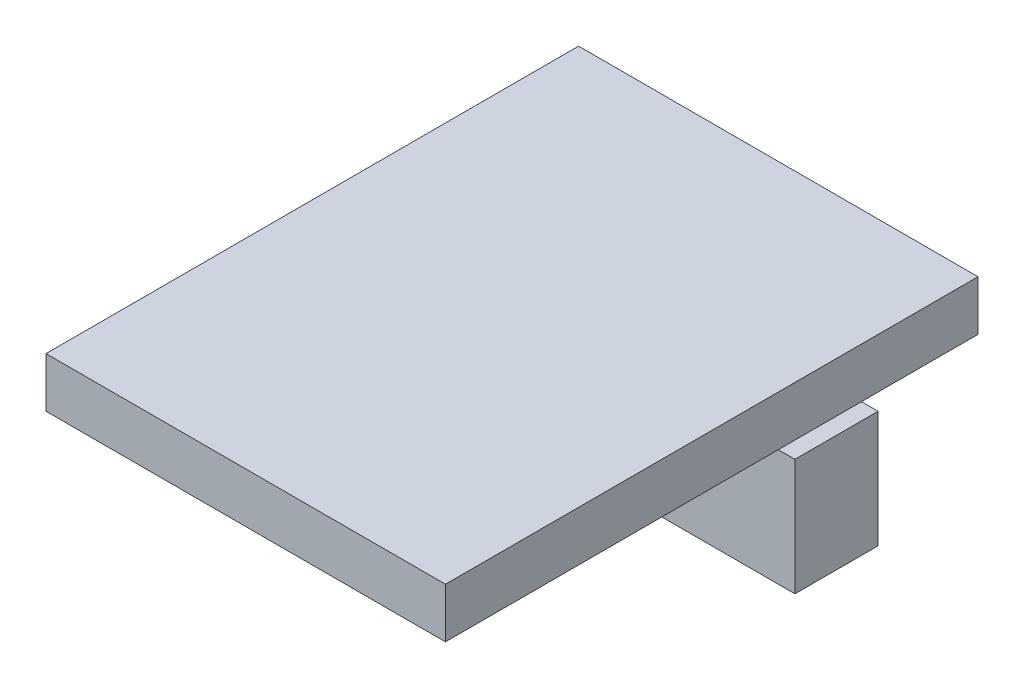
ISO-10303-21;
HEADER;
FILE_DESCRIPTION(('STEP AP214'),'2;1');
FILE_NAME('part.step','',(''),(''),'','','');
FILE_SCHEMA(('AUTOMOTIVE_DESIGN { 1 0 10303 214 1 1 1 1 }'));
ENDSEC;
DATA;
#1=APPLICATION_CONTEXT('core data for automotive mechanical design processes');
#2=APPLICATION_PROTOCOL_DEFINITION('international standard','automotive_design',2000,#1);
#3=PRODUCT_CONTEXT('',#1,'mechanical');
#4=PRODUCT('Part','Part','',(#3));
#5=PRODUCT_RELATED_PRODUCT_CATEGORY('part','',(#4));
#6=PRODUCT_DEFINITION_FORMATION('','',#4);
#7=PRODUCT_DEFINITION_CONTEXT('part definition',#1,'design');
#8=PRODUCT_DEFINITION('design','',#6,#7);
#9=PRODUCT_DEFINITION_SHAPE('','',#8);
#10=(LENGTH_UNIT() NAMED_UNIT(*) SI_UNIT(.MILLI.,.METRE.));
#11=(NAMED_UNIT(*) PLANE_ANGLE_UNIT() SI_UNIT($,.RADIAN.));
#12=(NAMED_UNIT(*) SI_UNIT($,.STERADIAN.) SOLID_ANGLE_UNIT());
#13=UNCERTAINTY_MEASURE_WITH_UNIT(LENGTH_MEASURE(1.E-05),#10,'distance_accuracy_value','');
#14=(GEOMETRIC_REPRESENTATION_CONTEXT(3) GLOBAL_UNCERTAINTY_ASSIGNED_CONTEXT((#13)) GLOBAL_UNIT_ASSIGNED_CONTEXT((#10,
#11,#12)) REPRESENTATION_CONTEXT('',''));
#15=CARTESIAN_POINT('',(0.,0.,0.));
#16=DIRECTION('',(0.,0.,1.));
#17=DIRECTION('',(1.,0.,0.));
#18=AXIS2_PLACEMENT_3D('',#15,#16,#17);
#19=CARTESIAN_POINT('',(-22.3304347826087,3.,-17.6347826086956));
#20=DIRECTION('',(1.,0.,0.));
#21=DIRECTION('',(0.,0.,-1.));
#22=AXIS2_PLACEMENT_3D('',#19,#20,#21);
#23=PLANE('',#22);
#24=DIRECTION('',(0.,0.,1.));
#25=VECTOR('',#24,1.);
#26=CARTESIAN_POINT('',(-22.3304347826087,0.,-17.6347826086956));
#27=LINE('',#26,#25);
#28=CARTESIAN_POINT('',(-22.3304347826087,0.,-17.6347826086956));
#29=VERTEX_POINT('',#28);
#30=CARTESIAN_POINT('',(-22.3304347826087,0.,14.3652173913044));
#31=VERTEX_POINT('',#30);
#32=EDGE_CURVE('E213',#29,#31,#27,.T.);
#33=ORIENTED_EDGE('',*,*,#32,.T.);
#34=DIRECTION('',(0.,-1.,0.));
#35=VECTOR('',#34,1.);
#36=CARTESIAN_POINT('',(-22.3304347826087,3.,14.3652173913044));
#37=LINE('',#36,#35);
#38=CARTESIAN_POINT('',(-22.3304347826087,3.,14.3652173913044));
#39=VERTEX_POINT('',#38);
#40=EDGE_CURVE('E246',#39,#31,#37,.T.);
#41=ORIENTED_EDGE('',*,*,#40,.F.);
#42=DIRECTION('',(0.,0.,1.));
#43=VECTOR('',#42,1.);
#44=CARTESIAN_POINT('',(-22.3304347826087,3.,-17.6347826086956));
#45=LINE('',#44,#43);
#46=CARTESIAN_POINT('',(-22.3304347826087,3.,-17.6347826086956));
#47=VERTEX_POINT('',#46);
#48=EDGE_CURVE('E220',#47,#39,#45,.T.);
#49=ORIENTED_EDGE('',*,*,#48,.F.);
#50=DIRECTION('',(0.,-1.,0.));
#51=VECTOR('',#50,1.);
#52=CARTESIAN_POINT('',(-22.3304347826087,3.,-17.6347826086956));
#53=LINE('',#52,#51);
#54=EDGE_CURVE('E230',#47,#29,#53,.T.);
#55=ORIENTED_EDGE('',*,*,#54,.T.);
#56=EDGE_LOOP('',(#33,#41,#49,#55));
#57=FACE_BOUND('',#56,.T.);
#58=ADVANCED_FACE('F33',(#57),#23,.F.);
#59=CARTESIAN_POINT('',(-22.3304347826087,3.,14.3652173913044));
#60=DIRECTION('',(0.,0.,-1.));
#61=DIRECTION('',(-1.,0.,0.));
#62=AXIS2_PLACEMENT_3D('',#59,#60,#61);
#63=PLANE('',#62);
#64=DIRECTION('',(1.,0.,0.));
#65=VECTOR('',#64,1.);
#66=CARTESIAN_POINT('',(-22.3304347826087,0.,14.3652173913044));
#67=LINE('',#66,#65);
#68=CARTESIAN_POINT('',(1.66956521739132,0.,14.3652173913044));
#69=VERTEX_POINT('',#68);
#70=EDGE_CURVE('E233',#31,#69,#67,.T.);
#71=ORIENTED_EDGE('',*,*,#70,.T.);
#72=DIRECTION('',(0.,-1.,0.));
#73=VECTOR('',#72,1.);
#74=CARTESIAN_POINT('',(1.66956521739132,3.,14.3652173913044));
#75=LINE('',#74,#73);
#76=CARTESIAN_POINT('',(1.66956521739132,3.,14.3652173913044));
#77=VERTEX_POINT('',#76);
#78=EDGE_CURVE('E243',#77,#69,#75,.T.);
#79=ORIENTED_EDGE('',*,*,#78,.F.);
#80=DIRECTION('',(1.,0.,0.));
#81=VECTOR('',#80,1.);
#82=CARTESIAN_POINT('',(-22.3304347826087,3.,14.3652173913044));
#83=LINE('',#82,#81);
#84=EDGE_CURVE('E223',#39,#77,#83,.T.);
#85=ORIENTED_EDGE('',*,*,#84,.F.);
#86=ORIENTED_EDGE('',*,*,#40,.T.);
#87=EDGE_LOOP('',(#71,#79,#85,#86));
#88=FACE_BOUND('',#87,.T.);
#89=ADVANCED_FACE('F293',(#88),#63,.F.);
#90=CARTESIAN_POINT('',(1.66956521739132,3.,-17.6347826086956));
#91=DIRECTION('',(-1.,0.,0.));
#92=DIRECTION('',(0.,0.,1.));
#93=AXIS2_PLACEMENT_3D('',#90,#91,#92);
#94=PLANE('',#93);
#95=DIRECTION('',(0.,0.,-1.));
#96=VECTOR('',#95,1.);
#97=CARTESIAN_POINT('',(1.66956521739132,0.,-17.6347826086956));
#98=LINE('',#97,#96);
#99=CARTESIAN_POINT('',(1.66956521739132,0.,-17.6347826086956));
#100=VERTEX_POINT('',#99);
#101=EDGE_CURVE('E235',#69,#100,#98,.T.);
#102=ORIENTED_EDGE('',*,*,#101,.T.);
#103=DIRECTION('',(0.,-1.,0.));
#104=VECTOR('',#103,1.);
#105=CARTESIAN_POINT('',(1.66956521739132,3.,-17.6347826086956));
#106=LINE('',#105,#104);
#107=CARTESIAN_POINT('',(1.66956521739132,3.,-17.6347826086956));
#108=VERTEX_POINT('',#107);
#109=EDGE_CURVE('E240',#108,#100,#106,.T.);
#110=ORIENTED_EDGE('',*,*,#109,.F.);
#111=DIRECTION('',(0.,0.,-1.));
#112=VECTOR('',#111,1.);
#113=CARTESIAN_POINT('',(1.66956521739132,3.,-17.6347826086956));
#114=LINE('',#113,#112);
#115=EDGE_CURVE('E226',#77,#108,#114,.T.);
#116=ORIENTED_EDGE('',*,*,#115,.F.);
#117=ORIENTED_EDGE('',*,*,#78,.T.);
#118=EDGE_LOOP('',(#102,#110,#116,#117));
#119=FACE_BOUND('',#118,.T.);
#120=ADVANCED_FACE('F298',(#119),#94,.F.);
#121=CARTESIAN_POINT('',(-22.3304347826087,3.,-17.6347826086956));
#122=DIRECTION('',(0.,0.,1.));
#123=DIRECTION('',(1.,0.,0.));
#124=AXIS2_PLACEMENT_3D('',#121,#122,#123);
#125=PLANE('',#124);
#126=DIRECTION('',(-1.,0.,0.));
#127=VECTOR('',#126,1.);
#128=CARTESIAN_POINT('',(-22.3304347826087,0.,-17.6347826086956));
#129=LINE('',#128,#127);
#130=EDGE_CURVE('E224',#100,#29,#129,.T.);
#131=ORIENTED_EDGE('',*,*,#130,.T.);
#132=ORIENTED_EDGE('',*,*,#54,.F.);
#133=DIRECTION('',(-1.,0.,0.));
#134=VECTOR('',#133,1.);
#135=CARTESIAN_POINT('',(-22.3304347826087,3.,-17.6347826086956));
#136=LINE('',#135,#134);
#137=EDGE_CURVE('E228',#108,#47,#136,.T.);
#138=ORIENTED_EDGE('',*,*,#137,.F.);
#139=ORIENTED_EDGE('',*,*,#109,.T.);
#140=EDGE_LOOP('',(#131,#132,#138,#139));
#141=FACE_BOUND('',#140,.T.);
#142=ADVANCED_FACE('F314',(#141),#125,.F.);
#143=CARTESIAN_POINT('',(0.,3.,0.));
#144=DIRECTION('',(0.,1.,0.));
#145=DIRECTION('',(0.,0.,1.));
#146=AXIS2_PLACEMENT_3D('',#143,#144,#145);
#147=PLANE('',#146);
#148=ORIENTED_EDGE('',*,*,#48,.T.);
#149=ORIENTED_EDGE('',*,*,#84,.T.);
#150=ORIENTED_EDGE('',*,*,#115,.T.);
#151=ORIENTED_EDGE('',*,*,#137,.T.);
#152=EDGE_LOOP('',(#148,#149,#150,#151));
#153=FACE_BOUND('',#152,.T.);
#154=ADVANCED_FACE('F310',(#153),#147,.T.);
#155=CARTESIAN_POINT('',(0.,0.,0.));
#156=DIRECTION('',(0.,1.,0.));
#157=DIRECTION('',(0.,0.,1.));
#158=AXIS2_PLACEMENT_3D('',#155,#156,#157);
#159=PLANE('',#158);
#160=DIRECTION('',(0.,0.,-1.));
#161=VECTOR('',#160,1.);
#162=CARTESIAN_POINT('',(-5.33043478260868,0.,0.));
#163=LINE('',#162,#161);
#164=CARTESIAN_POINT('',(-5.33043478260868,0.,-9.63478260869564));
#165=VERTEX_POINT('',#164);
#166=CARTESIAN_POINT('',(-5.33043478260868,0.,-12.6347826086956));
#167=VERTEX_POINT('',#166);
#168=EDGE_CURVE('E40',#165,#167,#163,.T.);
#169=ORIENTED_EDGE('',*,*,#168,.T.);
#170=DIRECTION('',(-1.,0.,0.));
#171=VECTOR('',#170,1.);
#172=CARTESIAN_POINT('',(0.,0.,-12.6347826086956));
#173=LINE('',#172,#171);
#174=CARTESIAN_POINT('',(-6.83043478260868,0.,-12.6347826086956));
#175=VERTEX_POINT('',#174);
#176=EDGE_CURVE('E11',#167,#175,#173,.T.);
#177=ORIENTED_EDGE('',*,*,#176,.T.);
#178=DIRECTION('',(0.,0.,1.));
#179=VECTOR('',#178,1.);
#180=CARTESIAN_POINT('',(-6.83043478260869,0.,0.));
#181=LINE('',#180,#179);
#182=CARTESIAN_POINT('',(-6.83043478260868,0.,-9.63478260869564));
#183=VERTEX_POINT('',#182);
#184=EDGE_CURVE('E261',#175,#183,#181,.T.);
#185=ORIENTED_EDGE('',*,*,#184,.T.);
#186=DIRECTION('',(1.,0.,0.));
#187=VECTOR('',#186,1.);
#188=CARTESIAN_POINT('',(0.,0.,-9.63478260869564));
#189=LINE('',#188,#187);
#190=EDGE_CURVE('E264',#183,#165,#189,.T.);
#191=ORIENTED_EDGE('',*,*,#190,.T.);
#192=EDGE_LOOP('',(#169,#177,#185,#191));
#193=FACE_BOUND('',#192,.T.);
#194=DIRECTION('',(-1.,0.,0.));
#195=VECTOR('',#194,1.);
#196=CARTESIAN_POINT('',(0.,0.,-12.6347826086956));
#197=LINE('',#196,#195);
#198=CARTESIAN_POINT('',(-13.8304347826087,0.,-12.6347826086956));
#199=VERTEX_POINT('',#198);
#200=CARTESIAN_POINT('',(-15.3304347826087,0.,-12.6347826086956));
#201=VERTEX_POINT('',#200);
#202=EDGE_CURVE('E255',#199,#201,#197,.T.);
#203=ORIENTED_EDGE('',*,*,#202,.T.);
#204=DIRECTION('',(0.,0.,1.));
#205=VECTOR('',#204,1.);
#206=CARTESIAN_POINT('',(-15.3304347826087,0.,0.));
#207=LINE('',#206,#205);
#208=CARTESIAN_POINT('',(-15.3304347826087,0.,-9.63478260869564));
#209=VERTEX_POINT('',#208);
#210=EDGE_CURVE('E258',#201,#209,#207,.T.);
#211=ORIENTED_EDGE('',*,*,#210,.T.);
#212=DIRECTION('',(1.,0.,0.));
#213=VECTOR('',#212,1.);
#214=CARTESIAN_POINT('',(0.,0.,-9.63478260869564));
#215=LINE('',#214,#213);
#216=CARTESIAN_POINT('',(-13.8304347826087,0.,-9.63478260869564));
#217=VERTEX_POINT('',#216);
#218=EDGE_CURVE('E249',#209,#217,#215,.T.);
#219=ORIENTED_EDGE('',*,*,#218,.T.);
#220=DIRECTION('',(0.,0.,-1.));
#221=VECTOR('',#220,1.);
#222=CARTESIAN_POINT('',(-13.8304347826087,0.,0.));
#223=LINE('',#222,#221);
#224=EDGE_CURVE('E252',#217,#199,#223,.T.);
#225=ORIENTED_EDGE('',*,*,#224,.T.);
#226=EDGE_LOOP('',(#203,#211,#219,#225));
#227=FACE_BOUND('',#226,.T.);
#228=ORIENTED_EDGE('',*,*,#32,.F.);
#229=ORIENTED_EDGE('',*,*,#130,.F.);
#230=ORIENTED_EDGE('',*,*,#101,.F.);
#231=ORIENTED_EDGE('',*,*,#70,.F.);
#232=EDGE_LOOP('',(#228,#229,#230,#231));
#233=FACE_BOUND('',#232,.T.);
#234=ADVANCED_FACE('F268',(#193,#227,#233),#159,.F.);
#235=CARTESIAN_POINT('',(-15.3304347826087,-3.,-12.6347826086956));
#236=DIRECTION('',(-1.,0.,0.));
#237=DIRECTION('',(0.,0.,1.));
#238=AXIS2_PLACEMENT_3D('',#235,#236,#237);
#239=PLANE('',#238);
#240=ORIENTED_EDGE('',*,*,#210,.F.);
#241=DIRECTION('',(0.,1.,0.));
#242=VECTOR('',#241,1.);
#243=CARTESIAN_POINT('',(-15.3304347826087,-3.,-12.6347826086956));
#244=LINE('',#243,#242);
#245=CARTESIAN_POINT('',(-15.3304347826087,-3.,-12.6347826086956));
#246=VERTEX_POINT('',#245);
#247=EDGE_CURVE('E210',#246,#201,#244,.T.);
#248=ORIENTED_EDGE('',*,*,#247,.F.);
#249=DIRECTION('',(0.,0.,1.));
#250=VECTOR('',#249,1.);
#251=CARTESIAN_POINT('',(-15.3304347826087,-3.,-12.6347826086956));
#252=LINE('',#251,#250);
#253=CARTESIAN_POINT('',(-15.3304347826087,-3.,-9.63478260869564));
#254=VERTEX_POINT('',#253);
#255=EDGE_CURVE('E192',#246,#254,#252,.T.);
#256=ORIENTED_EDGE('',*,*,#255,.T.);
#257=DIRECTION('',(0.,1.,0.));
#258=VECTOR('',#257,1.);
#259=CARTESIAN_POINT('',(-15.3304347826087,-3.,-9.63478260869564));
#260=LINE('',#259,#258);
#261=EDGE_CURVE('E209',#254,#209,#260,.T.);
#262=ORIENTED_EDGE('',*,*,#261,.T.);
#263=EDGE_LOOP('',(#240,#248,#256,#262));
#264=FACE_BOUND('',#263,.T.);
#265=ADVANCED_FACE('F325',(#264),#239,.T.);
#266=CARTESIAN_POINT('',(-15.3304347826087,-3.,-12.6347826086956));
#267=DIRECTION('',(0.,0.,-1.));
#268=DIRECTION('',(-1.,0.,0.));
#269=AXIS2_PLACEMENT_3D('',#266,#267,#268);
#270=PLANE('',#269);
#271=ORIENTED_EDGE('',*,*,#202,.F.);
#272=DIRECTION('',(0.,1.,0.));
#273=VECTOR('',#272,1.);
#274=CARTESIAN_POINT('',(-13.8304347826087,-3.,-12.6347826086956));
#275=LINE('',#274,#273);
#276=CARTESIAN_POINT('',(-13.8304347826087,-3.,-12.6347826086956));
#277=VERTEX_POINT('',#276);
#278=EDGE_CURVE('E214',#277,#199,#275,.T.);
#279=ORIENTED_EDGE('',*,*,#278,.F.);
#280=DIRECTION('',(-1.,0.,0.));
#281=VECTOR('',#280,1.);
#282=CARTESIAN_POINT('',(-15.3304347826087,-3.,-12.6347826086956));
#283=LINE('',#282,#281);
#284=EDGE_CURVE('E206',#277,#246,#283,.T.);
#285=ORIENTED_EDGE('',*,*,#284,.T.);
#286=ORIENTED_EDGE('',*,*,#247,.T.);
#287=EDGE_LOOP('',(#271,#279,#285,#286));
#288=FACE_BOUND('',#287,.T.);
#289=ADVANCED_FACE('F330',(#288),#270,.T.);
#290=CARTESIAN_POINT('',(-13.8304347826087,-3.,-12.6347826086956));
#291=DIRECTION('',(1.,0.,0.));
#292=DIRECTION('',(0.,0.,-1.));
#293=AXIS2_PLACEMENT_3D('',#290,#291,#292);
#294=PLANE('',#293);
#295=ORIENTED_EDGE('',*,*,#224,.F.);
#296=DIRECTION('',(0.,1.,0.));
#297=VECTOR('',#296,1.);
#298=CARTESIAN_POINT('',(-13.8304347826087,-3.,-9.63478260869564));
#299=LINE('',#298,#297);
#300=CARTESIAN_POINT('',(-13.8304347826087,-3.,-9.63478260869564));
#301=VERTEX_POINT('',#300);
#302=EDGE_CURVE('E55',#301,#217,#299,.T.);
#303=ORIENTED_EDGE('',*,*,#302,.F.);
#304=DIRECTION('',(0.,0.,-1.));
#305=VECTOR('',#304,1.);
#306=CARTESIAN_POINT('',(-13.8304347826087,-3.,-12.6347826086956));
#307=LINE('',#306,#305);
#308=EDGE_CURVE('E203',#301,#277,#307,.T.);
#309=ORIENTED_EDGE('',*,*,#308,.T.);
#310=ORIENTED_EDGE('',*,*,#278,.T.);
#311=EDGE_LOOP('',(#295,#303,#309,#310));
#312=FACE_BOUND('',#311,.T.);
#313=ADVANCED_FACE('F335',(#312),#294,.T.);
#314=CARTESIAN_POINT('',(-15.3304347826087,-3.,-9.63478260869564));
#315=DIRECTION('',(0.,0.,1.));
#316=DIRECTION('',(1.,0.,0.));
#317=AXIS2_PLACEMENT_3D('',#314,#315,#316);
#318=PLANE('',#317);
#319=ORIENTED_EDGE('',*,*,#218,.F.);
#320=ORIENTED_EDGE('',*,*,#261,.F.);
#321=DIRECTION('',(1.,0.,0.));
#322=VECTOR('',#321,1.);
#323=CARTESIAN_POINT('',(-15.3304347826087,-3.,-9.63478260869564));
#324=LINE('',#323,#322);
#325=EDGE_CURVE('E201',#254,#301,#324,.T.);
#326=ORIENTED_EDGE('',*,*,#325,.T.);
#327=ORIENTED_EDGE('',*,*,#302,.T.);
#328=EDGE_LOOP('',(#319,#320,#326,#327));
#329=FACE_BOUND('',#328,.T.);
#330=ADVANCED_FACE('F332',(#329),#318,.T.);
#331=CARTESIAN_POINT('',(-6.83043478260868,-3.,-12.6347826086956));
#332=DIRECTION('',(0.,0.,-1.));
#333=DIRECTION('',(-1.,0.,0.));
#334=AXIS2_PLACEMENT_3D('',#331,#332,#333);
#335=PLANE('',#334);
#336=ORIENTED_EDGE('',*,*,#176,.F.);
#337=DIRECTION('',(0.,1.,0.));
#338=VECTOR('',#337,1.);
#339=CARTESIAN_POINT('',(-5.33043478260868,-3.,-12.6347826086956));
#340=LINE('',#339,#338);
#341=CARTESIAN_POINT('',(-5.33043478260868,-3.,-12.6347826086956));
#342=VERTEX_POINT('',#341);
#343=EDGE_CURVE('E189',#342,#167,#340,.T.);
#344=ORIENTED_EDGE('',*,*,#343,.F.);
#345=DIRECTION('',(-1.,0.,0.));
#346=VECTOR('',#345,1.);
#347=CARTESIAN_POINT('',(-6.83043478260868,-3.,-12.6347826086956));
#348=LINE('',#347,#346);
#349=CARTESIAN_POINT('',(-6.83043478260868,-3.,-12.6347826086956));
#350=VERTEX_POINT('',#349);
#351=EDGE_CURVE('E172',#342,#350,#348,.T.);
#352=ORIENTED_EDGE('',*,*,#351,.T.);
#353=DIRECTION('',(0.,1.,0.));
#354=VECTOR('',#353,1.);
#355=CARTESIAN_POINT('',(-6.83043478260868,-3.,-12.6347826086956));
#356=LINE('',#355,#354);
#357=EDGE_CURVE('E188',#350,#175,#356,.T.);
#358=ORIENTED_EDGE('',*,*,#357,.T.);
#359=EDGE_LOOP('',(#336,#344,#352,#358));
#360=FACE_BOUND('',#359,.T.);
#361=ADVANCED_FACE('F281',(#360),#335,.T.);
#362=CARTESIAN_POINT('',(-5.33043478260868,-3.,-12.6347826086956));
#363=DIRECTION('',(1.,0.,0.));
#364=DIRECTION('',(0.,0.,-1.));
#365=AXIS2_PLACEMENT_3D('',#362,#363,#364);
#366=PLANE('',#365);
#367=ORIENTED_EDGE('',*,*,#168,.F.);
#368=DIRECTION('',(0.,1.,0.));
#369=VECTOR('',#368,1.);
#370=CARTESIAN_POINT('',(-5.33043478260868,-3.,-9.63478260869564));
#371=LINE('',#370,#369);
#372=CARTESIAN_POINT('',(-5.33043478260868,-3.,-9.63478260869564));
#373=VERTEX_POINT('',#372);
#374=EDGE_CURVE('E193',#373,#165,#371,.T.);
#375=ORIENTED_EDGE('',*,*,#374,.F.);
#376=DIRECTION('',(0.,0.,-1.));
#377=VECTOR('',#376,1.);
#378=CARTESIAN_POINT('',(-5.33043478260868,-3.,-12.6347826086956));
#379=LINE('',#378,#377);
#380=EDGE_CURVE('E185',#373,#342,#379,.T.);
#381=ORIENTED_EDGE('',*,*,#380,.T.);
#382=ORIENTED_EDGE('',*,*,#343,.T.);
#383=EDGE_LOOP('',(#367,#375,#381,#382));
#384=FACE_BOUND('',#383,.T.);
#385=ADVANCED_FACE('F272',(#384),#366,.T.);
#386=CARTESIAN_POINT('',(-6.83043478260868,-3.,-9.63478260869564));
#387=DIRECTION('',(0.,0.,1.));
#388=DIRECTION('',(1.,0.,0.));
#389=AXIS2_PLACEMENT_3D('',#386,#387,#388);
#390=PLANE('',#389);
#391=ORIENTED_EDGE('',*,*,#190,.F.);
#392=DIRECTION('',(0.,1.,0.));
#393=VECTOR('',#392,1.);
#394=CARTESIAN_POINT('',(-6.83043478260868,-3.,-9.63478260869564));
#395=LINE('',#394,#393);
#396=CARTESIAN_POINT('',(-6.83043478260868,-3.,-9.63478260869564));
#397=VERTEX_POINT('',#396);
#398=EDGE_CURVE('E47',#397,#183,#395,.T.);
#399=ORIENTED_EDGE('',*,*,#398,.F.);
#400=DIRECTION('',(1.,0.,0.));
#401=VECTOR('',#400,1.);
#402=CARTESIAN_POINT('',(-6.83043478260868,-3.,-9.63478260869564));
#403=LINE('',#402,#401);
#404=EDGE_CURVE('E182',#397,#373,#403,.T.);
#405=ORIENTED_EDGE('',*,*,#404,.T.);
#406=ORIENTED_EDGE('',*,*,#374,.T.);
#407=EDGE_LOOP('',(#391,#399,#405,#406));
#408=FACE_BOUND('',#407,.T.);
#409=ADVANCED_FACE('F275',(#408),#390,.T.);
#410=CARTESIAN_POINT('',(-6.83043478260868,-3.,-12.6347826086956));
#411=DIRECTION('',(-1.,0.,0.));
#412=DIRECTION('',(0.,0.,1.));
#413=AXIS2_PLACEMENT_3D('',#410,#411,#412);
#414=PLANE('',#413);
#415=ORIENTED_EDGE('',*,*,#184,.F.);
#416=ORIENTED_EDGE('',*,*,#357,.F.);
#417=DIRECTION('',(0.,0.,1.));
#418=VECTOR('',#417,1.);
#419=CARTESIAN_POINT('',(-6.83043478260868,-3.,-12.6347826086956));
#420=LINE('',#419,#418);
#421=EDGE_CURVE('E175',#350,#397,#420,.T.);
#422=ORIENTED_EDGE('',*,*,#421,.T.);
#423=ORIENTED_EDGE('',*,*,#398,.T.);
#424=EDGE_LOOP('',(#415,#416,#422,#423));
#425=FACE_BOUND('',#424,.T.);
#426=ADVANCED_FACE('F282',(#425),#414,.T.);
#427=CARTESIAN_POINT('',(-20.3304347826087,-10.,-8.63478260869564));
#428=DIRECTION('',(1.,0.,0.));
#429=DIRECTION('',(0.,0.,-1.));
#430=AXIS2_PLACEMENT_3D('',#427,#428,#429);
#431=PLANE('',#430);
#432=DIRECTION('',(0.,0.,-1.));
#433=VECTOR('',#432,1.);
#434=CARTESIAN_POINT('',(-20.3304347826087,-3.,-8.63478260869564));
#435=LINE('',#434,#433);
#436=CARTESIAN_POINT('',(-20.3304347826087,-3.,-8.63478260869564));
#437=VERTEX_POINT('',#436);
#438=CARTESIAN_POINT('',(-20.3304347826087,-3.,-13.6347826086956));
#439=VERTEX_POINT('',#438);
#440=EDGE_CURVE('E171',#437,#439,#435,.T.);
#441=ORIENTED_EDGE('',*,*,#440,.T.);
#442=DIRECTION('',(0.,1.,0.));
#443=VECTOR('',#442,1.);
#444=CARTESIAN_POINT('',(-20.3304347826087,-10.,-13.6347826086956));
#445=LINE('',#444,#443);
#446=CARTESIAN_POINT('',(-20.3304347826087,-10.,-13.6347826086956));
#447=VERTEX_POINT('',#446);
#448=EDGE_CURVE('E151',#447,#439,#445,.T.);
#449=ORIENTED_EDGE('',*,*,#448,.F.);
#450=DIRECTION('',(0.,0.,-1.));
#451=VECTOR('',#450,1.);
#452=CARTESIAN_POINT('',(-20.3304347826087,-10.,-8.63478260869564));
#453=LINE('',#452,#451);
#454=CARTESIAN_POINT('',(-20.3304347826087,-10.,-8.63478260869564));
#455=VERTEX_POINT('',#454);
#456=EDGE_CURVE('E158',#455,#447,#453,.T.);
#457=ORIENTED_EDGE('',*,*,#456,.F.);
#458=DIRECTION('',(0.,1.,0.));
#459=VECTOR('',#458,1.);
#460=CARTESIAN_POINT('',(-20.3304347826087,-10.,-8.63478260869564));
#461=LINE('',#460,#459);
#462=EDGE_CURVE('E478',#455,#437,#461,.T.);
#463=ORIENTED_EDGE('',*,*,#462,.T.);
#464=EDGE_LOOP('',(#441,#449,#457,#463));
#465=FACE_BOUND('',#464,.T.);
#466=ADVANCED_FACE('F169',(#465),#431,.F.);
#467=CARTESIAN_POINT('',(-20.3304347826087,-10.,-13.6347826086956));
#468=DIRECTION('',(0.,0.,1.));
#469=DIRECTION('',(1.,0.,0.));
#470=AXIS2_PLACEMENT_3D('',#467,#468,#469);
#471=PLANE('',#470);
#472=DIRECTION('',(1.,0.,0.));
#473=VECTOR('',#472,1.);
#474=CARTESIAN_POINT('',(-20.3304347826087,-3.,-13.6347826086956));
#475=LINE('',#474,#473);
#476=CARTESIAN_POINT('',(-0.330434782608683,-3.,-13.6347826086956));
#477=VERTEX_POINT('',#476);
#478=EDGE_CURVE('E484',#439,#477,#475,.T.);
#479=ORIENTED_EDGE('',*,*,#478,.T.);
#480=DIRECTION('',(0.,1.,0.));
#481=VECTOR('',#480,1.);
#482=CARTESIAN_POINT('',(-0.330434782608683,-10.,-13.6347826086956));
#483=LINE('',#482,#481);
#484=CARTESIAN_POINT('',(-0.330434782608683,-10.,-13.6347826086956));
#485=VERTEX_POINT('',#484);
#486=EDGE_CURVE('E154',#485,#477,#483,.T.);
#487=ORIENTED_EDGE('',*,*,#486,.F.);
#488=DIRECTION('',(1.,0.,0.));
#489=VECTOR('',#488,1.);
#490=CARTESIAN_POINT('',(-20.3304347826087,-10.,-13.6347826086956));
#491=LINE('',#490,#489);
#492=EDGE_CURVE('E147',#447,#485,#491,.T.);
#493=ORIENTED_EDGE('',*,*,#492,.F.);
#494=ORIENTED_EDGE('',*,*,#448,.T.);
#495=EDGE_LOOP('',(#479,#487,#493,#494));
#496=FACE_BOUND('',#495,.T.);
#497=ADVANCED_FACE('F149',(#496),#471,.F.);
#498=CARTESIAN_POINT('',(-0.330434782608684,-10.,-8.63478260869564));
#499=DIRECTION('',(-1.,0.,0.));
#500=DIRECTION('',(0.,0.,1.));
#501=AXIS2_PLACEMENT_3D('',#498,#499,#500);
#502=PLANE('',#501);
#503=DIRECTION('',(0.,0.,1.));
#504=VECTOR('',#503,1.);
#505=CARTESIAN_POINT('',(-0.330434782608684,-3.,-8.63478260869564));
#506=LINE('',#505,#504);
#507=CARTESIAN_POINT('',(-0.330434782608684,-3.,-8.63478260869564));
#508=VERTEX_POINT('',#507);
#509=EDGE_CURVE('E481',#477,#508,#506,.T.);
#510=ORIENTED_EDGE('',*,*,#509,.T.);
#511=DIRECTION('',(0.,1.,0.));
#512=VECTOR('',#511,1.);
#513=CARTESIAN_POINT('',(-0.330434782608684,-10.,-8.63478260869564));
#514=LINE('',#513,#512);
#515=CARTESIAN_POINT('',(-0.330434782608684,-10.,-8.63478260869564));
#516=VERTEX_POINT('',#515);
#517=EDGE_CURVE('E177',#516,#508,#514,.T.);
#518=ORIENTED_EDGE('',*,*,#517,.F.);
#519=DIRECTION('',(0.,0.,1.));
#520=VECTOR('',#519,1.);
#521=CARTESIAN_POINT('',(-0.330434782608684,-10.,-8.63478260869564));
#522=LINE('',#521,#520);
#523=EDGE_CURVE('E157',#485,#516,#522,.T.);
#524=ORIENTED_EDGE('',*,*,#523,.F.);
#525=ORIENTED_EDGE('',*,*,#486,.T.);
#526=EDGE_LOOP('',(#510,#518,#524,#525));
#527=FACE_BOUND('',#526,.T.);
#528=ADVANCED_FACE('F351',(#527),#502,.F.);
#529=CARTESIAN_POINT('',(-20.3304347826087,-10.,-8.63478260869564));
#530=DIRECTION('',(0.,0.,-1.));
#531=DIRECTION('',(-1.,0.,0.));
#532=AXIS2_PLACEMENT_3D('',#529,#530,#531);
#533=PLANE('',#532);
#534=DIRECTION('',(-1.,0.,0.));
#535=VECTOR('',#534,1.);
#536=CARTESIAN_POINT('',(-20.3304347826087,-3.,-8.63478260869564));
#537=LINE('',#536,#535);
#538=EDGE_CURVE('E167',#508,#437,#537,.T.);
#539=ORIENTED_EDGE('',*,*,#538,.T.);
#540=ORIENTED_EDGE('',*,*,#462,.F.);
#541=DIRECTION('',(-1.,0.,0.));
#542=VECTOR('',#541,1.);
#543=CARTESIAN_POINT('',(-20.3304347826087,-10.,-8.63478260869564));
#544=LINE('',#543,#542);
#545=EDGE_CURVE('E163',#516,#455,#544,.T.);
#546=ORIENTED_EDGE('',*,*,#545,.F.);
#547=ORIENTED_EDGE('',*,*,#517,.T.);
#548=EDGE_LOOP('',(#539,#540,#546,#547));
#549=FACE_BOUND('',#548,.T.);
#550=ADVANCED_FACE('F354',(#549),#533,.F.);
#551=CARTESIAN_POINT('',(0.,-10.,0.));
#552=DIRECTION('',(0.,-1.,0.));
#553=DIRECTION('',(0.,0.,-1.));
#554=AXIS2_PLACEMENT_3D('',#551,#552,#553);
#555=PLANE('',#554);
#556=ORIENTED_EDGE('',*,*,#456,.T.);
#557=ORIENTED_EDGE('',*,*,#492,.T.);
#558=ORIENTED_EDGE('',*,*,#523,.T.);
#559=ORIENTED_EDGE('',*,*,#545,.T.);
#560=EDGE_LOOP('',(#556,#557,#558,#559));
#561=FACE_BOUND('',#560,.T.);
#562=ADVANCED_FACE('F161',(#561),#555,.T.);
#563=CARTESIAN_POINT('',(0.,-3.,0.));
#564=DIRECTION('',(0.,-1.,0.));
#565=DIRECTION('',(0.,0.,-1.));
#566=AXIS2_PLACEMENT_3D('',#563,#564,#565);
#567=PLANE('',#566);
#568=ORIENTED_EDGE('',*,*,#255,.F.);
#569=ORIENTED_EDGE('',*,*,#284,.F.);
#570=ORIENTED_EDGE('',*,*,#308,.F.);
#571=ORIENTED_EDGE('',*,*,#325,.F.);
#572=EDGE_LOOP('',(#568,#569,#570,#571));
#573=FACE_BOUND('',#572,.T.);
#574=ORIENTED_EDGE('',*,*,#351,.F.);
#575=ORIENTED_EDGE('',*,*,#380,.F.);
#576=ORIENTED_EDGE('',*,*,#404,.F.);
#577=ORIENTED_EDGE('',*,*,#421,.F.);
#578=EDGE_LOOP('',(#574,#575,#576,#577));
#579=FACE_BOUND('',#578,.T.);
#580=ORIENTED_EDGE('',*,*,#440,.F.);
#581=ORIENTED_EDGE('',*,*,#538,.F.);
#582=ORIENTED_EDGE('',*,*,#509,.F.);
#583=ORIENTED_EDGE('',*,*,#478,.F.);
#584=EDGE_LOOP('',(#580,#581,#582,#583));
#585=FACE_BOUND('',#584,.T.);
#586=ADVANCED_FACE('F277',(#573,#579,#585),#567,.F.);
#587=CLOSED_SHELL('',(#58,#89,#120,#142,#154,#234,#265,#289,#313,#330,#361,#385,#409,#426,#466,
#497,#528,#550,#562,#586));
#588=MANIFOLD_SOLID_BREP('B2',#587);
#589=ADVANCED_BREP_SHAPE_REPRESENTATION('',(#18,#588),#14);
#590=SHAPE_DEFINITION_REPRESENTATION(#9,#589);
ENDSEC;
END-ISO-10303-21;
